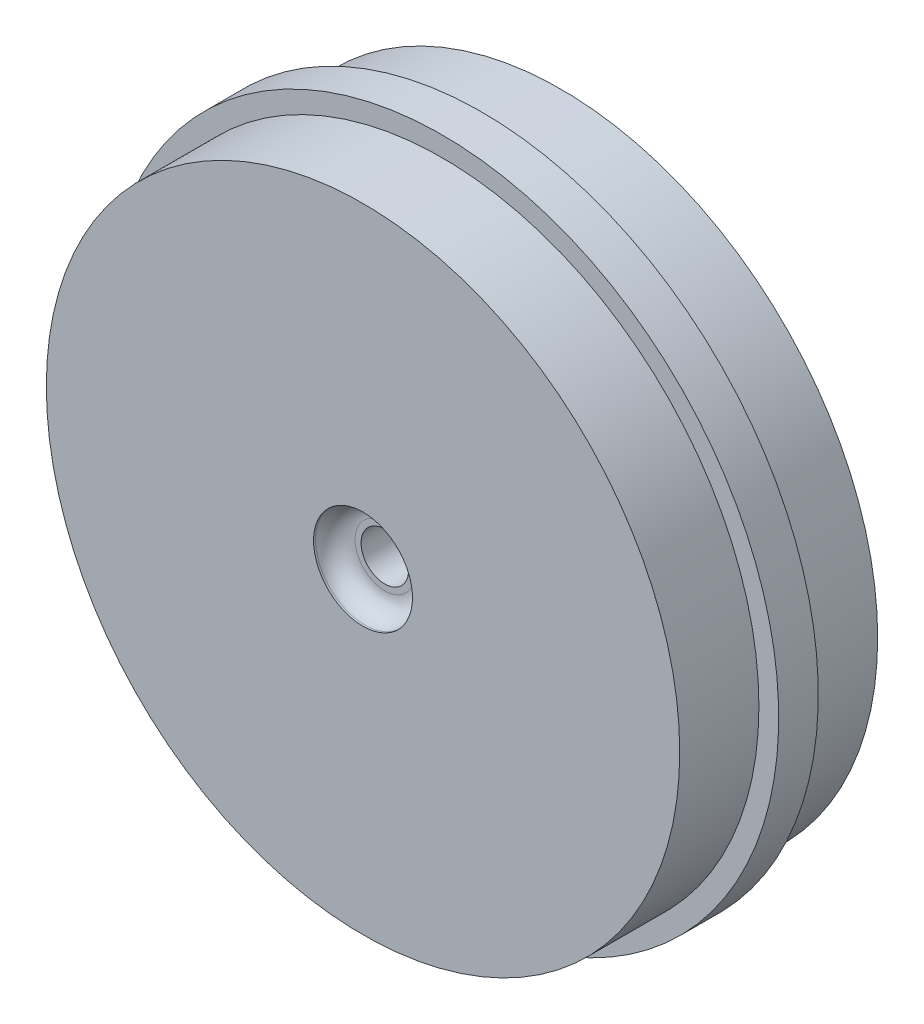
ISO-10303-21;
HEADER;
FILE_DESCRIPTION(('STEP AP214'),'2;1');
FILE_NAME('part.step','',(''),(''),'','','');
FILE_SCHEMA(('AUTOMOTIVE_DESIGN { 1 0 10303 214 1 1 1 1 }'));
ENDSEC;
DATA;
#1=APPLICATION_CONTEXT('core data for automotive mechanical design processes');
#2=APPLICATION_PROTOCOL_DEFINITION('international standard','automotive_design',2000,#1);
#3=PRODUCT_CONTEXT('',#1,'mechanical');
#4=PRODUCT('Part','Part','',(#3));
#5=PRODUCT_RELATED_PRODUCT_CATEGORY('part','',(#4));
#6=PRODUCT_DEFINITION_FORMATION('','',#4);
#7=PRODUCT_DEFINITION_CONTEXT('part definition',#1,'design');
#8=PRODUCT_DEFINITION('design','',#6,#7);
#9=PRODUCT_DEFINITION_SHAPE('','',#8);
#10=(LENGTH_UNIT() NAMED_UNIT(*) SI_UNIT(.MILLI.,.METRE.));
#11=(NAMED_UNIT(*) PLANE_ANGLE_UNIT() SI_UNIT($,.RADIAN.));
#12=(NAMED_UNIT(*) SI_UNIT($,.STERADIAN.) SOLID_ANGLE_UNIT());
#13=UNCERTAINTY_MEASURE_WITH_UNIT(LENGTH_MEASURE(1.E-05),#10,'distance_accuracy_value','');
#14=(GEOMETRIC_REPRESENTATION_CONTEXT(3) GLOBAL_UNCERTAINTY_ASSIGNED_CONTEXT((#13)) GLOBAL_UNIT_ASSIGNED_CONTEXT((#10,
#11,#12)) REPRESENTATION_CONTEXT('',''));
#15=CARTESIAN_POINT('',(0.,0.,0.));
#16=DIRECTION('',(0.,0.,1.));
#17=DIRECTION('',(1.,0.,0.));
#18=AXIS2_PLACEMENT_3D('',#15,#16,#17);
#19=CARTESIAN_POINT('',(0.,0.,20.));
#20=DIRECTION('',(0.,0.,-1.));
#21=DIRECTION('',(-1.,0.,0.));
#22=AXIS2_PLACEMENT_3D('',#19,#20,#21);
#23=CYLINDRICAL_SURFACE('',#22,16.);
#24=CARTESIAN_POINT('',(0.,0.,10.));
#25=DIRECTION('',(0.,0.,1.));
#26=DIRECTION('',(1.,0.,0.));
#27=AXIS2_PLACEMENT_3D('',#24,#25,#26);
#28=CIRCLE('',#27,16.);
#29=CARTESIAN_POINT('',(16.,0.,10.));
#30=VERTEX_POINT('',#29);
#31=EDGE_CURVE('E110',#30,#30,#28,.T.);
#32=ORIENTED_EDGE('',*,*,#31,.F.);
#33=EDGE_LOOP('',(#32));
#34=FACE_BOUND('',#33,.T.);
#35=CARTESIAN_POINT('',(0.,0.,6.));
#36=DIRECTION('',(0.,0.,-1.));
#37=DIRECTION('',(-1.,0.,0.));
#38=AXIS2_PLACEMENT_3D('',#35,#36,#37);
#39=CIRCLE('',#38,16.);
#40=CARTESIAN_POINT('',(-16.,0.,6.));
#41=VERTEX_POINT('',#40);
#42=EDGE_CURVE('E188',#41,#41,#39,.T.);
#43=ORIENTED_EDGE('',*,*,#42,.F.);
#44=EDGE_LOOP('',(#43));
#45=FACE_BOUND('',#44,.T.);
#46=ADVANCED_FACE('F37',(#34,#45),#23,.T.);
#47=CARTESIAN_POINT('',(0.,0.,0.));
#48=DIRECTION('',(0.,0.,1.));
#49=DIRECTION('',(1.,0.,0.));
#50=AXIS2_PLACEMENT_3D('',#47,#48,#49);
#51=PLANE('',#50);
#52=CARTESIAN_POINT('',(0.,0.,0.));
#53=DIRECTION('',(0.,0.,-1.));
#54=DIRECTION('',(-1.,0.,0.));
#55=AXIS2_PLACEMENT_3D('',#52,#53,#54);
#56=CIRCLE('',#55,13.5);
#57=CARTESIAN_POINT('',(-13.5,0.,0.));
#58=VERTEX_POINT('',#57);
#59=EDGE_CURVE('E119',#58,#58,#56,.T.);
#60=ORIENTED_EDGE('',*,*,#59,.F.);
#61=EDGE_LOOP('',(#60));
#62=FACE_BOUND('',#61,.T.);
#63=CARTESIAN_POINT('',(0.,0.,0.));
#64=DIRECTION('',(0.,0.,-1.));
#65=DIRECTION('',(-1.,0.,0.));
#66=AXIS2_PLACEMENT_3D('',#63,#64,#65);
#67=CIRCLE('',#66,16.);
#68=CARTESIAN_POINT('',(-16.,0.,0.));
#69=VERTEX_POINT('',#68);
#70=EDGE_CURVE('E136',#69,#69,#67,.T.);
#71=ORIENTED_EDGE('',*,*,#70,.T.);
#72=EDGE_LOOP('',(#71));
#73=FACE_BOUND('',#72,.T.);
#74=ADVANCED_FACE('F153',(#62,#73),#51,.F.);
#75=CARTESIAN_POINT('',(0.,0.,10.));
#76=DIRECTION('',(0.,0.,1.));
#77=DIRECTION('',(1.,0.,0.));
#78=AXIS2_PLACEMENT_3D('',#75,#76,#77);
#79=PLANE('',#78);
#80=ORIENTED_EDGE('',*,*,#31,.T.);
#81=EDGE_LOOP('',(#80));
#82=FACE_BOUND('',#81,.T.);
#83=CARTESIAN_POINT('',(0.,0.,10.));
#84=DIRECTION('',(0.,0.,1.));
#85=DIRECTION('',(1.,0.,0.));
#86=AXIS2_PLACEMENT_3D('',#83,#84,#85);
#87=CIRCLE('',#86,2.5);
#88=CARTESIAN_POINT('',(2.5,0.,10.));
#89=VERTEX_POINT('',#88);
#90=EDGE_CURVE('E192',#89,#89,#87,.T.);
#91=ORIENTED_EDGE('',*,*,#90,.F.);
#92=EDGE_LOOP('',(#91));
#93=FACE_BOUND('',#92,.T.);
#94=ADVANCED_FACE('F160',(#82,#93),#79,.T.);
#95=CARTESIAN_POINT('',(0.,0.,9.));
#96=DIRECTION('',(0.,0.,1.));
#97=DIRECTION('',(1.,0.,0.));
#98=AXIS2_PLACEMENT_3D('',#95,#96,#97);
#99=CYLINDRICAL_SURFACE('',#98,1.2);
#100=CARTESIAN_POINT('',(0.,0.,7.));
#101=DIRECTION('',(0.,0.,-1.));
#102=DIRECTION('',(-1.,0.,0.));
#103=AXIS2_PLACEMENT_3D('',#100,#101,#102);
#104=CIRCLE('',#103,1.2);
#105=CARTESIAN_POINT('',(-1.2,0.,7.));
#106=VERTEX_POINT('',#105);
#107=EDGE_CURVE('E116',#106,#106,#104,.F.);
#108=ORIENTED_EDGE('',*,*,#107,.F.);
#109=EDGE_LOOP('',(#108));
#110=FACE_BOUND('',#109,.T.);
#111=CARTESIAN_POINT('',(0.,0.,8.9));
#112=DIRECTION('',(0.,0.,1.));
#113=DIRECTION('',(1.,0.,0.));
#114=AXIS2_PLACEMENT_3D('',#111,#112,#113);
#115=CIRCLE('',#114,1.2);
#116=CARTESIAN_POINT('',(1.2,0.,8.9));
#117=VERTEX_POINT('',#116);
#118=EDGE_CURVE('E195',#117,#117,#115,.T.);
#119=ORIENTED_EDGE('',*,*,#118,.T.);
#120=EDGE_LOOP('',(#119));
#121=FACE_BOUND('',#120,.T.);
#122=ADVANCED_FACE('F199',(#110,#121),#99,.F.);
#123=DIRECTION('',(0.,-1.,0.));
#124=VECTOR('',#123,1.);
#125=CARTESIAN_POINT('',(1.9,1.9880895352071,0.));
#126=LINE('',#125,#124);
#127=CARTESIAN_POINT('',(1.9,1.9880895352071,0.));
#128=VERTEX_POINT('',#127);
#129=CARTESIAN_POINT('',(1.9,-1.9880895352071,0.));
#130=VERTEX_POINT('',#129);
#131=EDGE_CURVE('E87',#128,#130,#126,.T.);
#132=ORIENTED_EDGE('',*,*,#131,.F.);
#133=CARTESIAN_POINT('',(0.,0.,0.));
#134=DIRECTION('',(0.,0.,-1.));
#135=DIRECTION('',(-1.,0.,0.));
#136=AXIS2_PLACEMENT_3D('',#133,#134,#135);
#137=CIRCLE('',#136,2.75);
#138=CARTESIAN_POINT('',(-1.9,1.9880895352071,0.));
#139=VERTEX_POINT('',#138);
#140=EDGE_CURVE('E52',#139,#128,#137,.T.);
#141=ORIENTED_EDGE('',*,*,#140,.F.);
#142=DIRECTION('',(0.,1.,0.));
#143=VECTOR('',#142,1.);
#144=CARTESIAN_POINT('',(-1.9,1.9880895352071,0.));
#145=LINE('',#144,#143);
#146=CARTESIAN_POINT('',(-1.9,-1.9880895352071,0.));
#147=VERTEX_POINT('',#146);
#148=EDGE_CURVE('E104',#147,#139,#145,.T.);
#149=ORIENTED_EDGE('',*,*,#148,.F.);
#150=CARTESIAN_POINT('',(0.,0.,0.));
#151=DIRECTION('',(0.,0.,-1.));
#152=DIRECTION('',(-1.,0.,0.));
#153=AXIS2_PLACEMENT_3D('',#150,#151,#152);
#154=CIRCLE('',#153,2.75);
#155=EDGE_CURVE('E112',#130,#147,#154,.T.);
#156=ORIENTED_EDGE('',*,*,#155,.F.);
#157=EDGE_LOOP('',(#132,#141,#149,#156));
#158=FACE_BOUND('',#157,.T.);
#159=CARTESIAN_POINT('',(0.,0.,0.));
#160=DIRECTION('',(0.,0.,-1.));
#161=DIRECTION('',(-1.,0.,0.));
#162=AXIS2_PLACEMENT_3D('',#159,#160,#161);
#163=CIRCLE('',#162,4.2);
#164=CARTESIAN_POINT('',(-4.2,0.,0.));
#165=VERTEX_POINT('',#164);
#166=EDGE_CURVE('E123',#165,#165,#163,.T.);
#167=ORIENTED_EDGE('',*,*,#166,.T.);
#168=EDGE_LOOP('',(#167));
#169=FACE_BOUND('',#168,.T.);
#170=ADVANCED_FACE('F162',(#158,#169),#51,.F.);
#171=CARTESIAN_POINT('',(0.,0.,9.));
#172=DIRECTION('',(0.,0.,1.));
#173=DIRECTION('',(1.,0.,0.));
#174=AXIS2_PLACEMENT_3D('',#171,#172,#173);
#175=CYLINDRICAL_SURFACE('',#174,2.5);
#176=CARTESIAN_POINT('',(0.,0.,9.9));
#177=DIRECTION('',(0.,0.,1.));
#178=DIRECTION('',(1.,0.,0.));
#179=AXIS2_PLACEMENT_3D('',#176,#177,#178);
#180=CIRCLE('',#179,2.5);
#181=CARTESIAN_POINT('',(2.5,0.,9.9));
#182=VERTEX_POINT('',#181);
#183=EDGE_CURVE('E12',#182,#182,#180,.F.);
#184=ORIENTED_EDGE('',*,*,#183,.T.);
#185=EDGE_LOOP('',(#184));
#186=FACE_BOUND('',#185,.T.);
#187=ORIENTED_EDGE('',*,*,#90,.T.);
#188=EDGE_LOOP('',(#187));
#189=FACE_BOUND('',#188,.T.);
#190=ADVANCED_FACE('F207',(#186,#189),#175,.F.);
#191=CARTESIAN_POINT('',(0.,0.,47.1837661840736));
#192=DIRECTION('',(0.,0.,-1.));
#193=DIRECTION('',(-1.,0.,0.));
#194=AXIS2_PLACEMENT_3D('',#191,#192,#193);
#195=CYLINDRICAL_SURFACE('',#194,13.5);
#196=ORIENTED_EDGE('',*,*,#59,.T.);
#197=EDGE_LOOP('',(#196));
#198=FACE_BOUND('',#197,.T.);
#199=CARTESIAN_POINT('',(0.,0.,7.));
#200=DIRECTION('',(0.,0.,1.));
#201=DIRECTION('',(1.,0.,0.));
#202=AXIS2_PLACEMENT_3D('',#199,#200,#201);
#203=CIRCLE('',#202,13.5);
#204=CARTESIAN_POINT('',(13.5,0.,7.));
#205=VERTEX_POINT('',#204);
#206=EDGE_CURVE('E126',#205,#205,#203,.F.);
#207=ORIENTED_EDGE('',*,*,#206,.F.);
#208=EDGE_LOOP('',(#207));
#209=FACE_BOUND('',#208,.T.);
#210=ADVANCED_FACE('F215',(#198,#209),#195,.F.);
#211=CARTESIAN_POINT('',(0.,0.,47.1837661840736));
#212=DIRECTION('',(0.,0.,-1.));
#213=DIRECTION('',(-1.,0.,0.));
#214=AXIS2_PLACEMENT_3D('',#211,#212,#213);
#215=CYLINDRICAL_SURFACE('',#214,4.2);
#216=ORIENTED_EDGE('',*,*,#166,.F.);
#217=EDGE_LOOP('',(#216));
#218=FACE_BOUND('',#217,.T.);
#219=CARTESIAN_POINT('',(0.,0.,7.));
#220=DIRECTION('',(0.,0.,1.));
#221=DIRECTION('',(1.,0.,0.));
#222=AXIS2_PLACEMENT_3D('',#219,#220,#221);
#223=CIRCLE('',#222,4.2);
#224=CARTESIAN_POINT('',(4.2,0.,7.));
#225=VERTEX_POINT('',#224);
#226=EDGE_CURVE('E122',#225,#225,#223,.F.);
#227=ORIENTED_EDGE('',*,*,#226,.T.);
#228=EDGE_LOOP('',(#227));
#229=FACE_BOUND('',#228,.T.);
#230=ADVANCED_FACE('F220',(#218,#229),#215,.T.);
#231=CARTESIAN_POINT('',(0.,0.,7.));
#232=DIRECTION('',(0.,0.,1.));
#233=DIRECTION('',(1.,0.,0.));
#234=AXIS2_PLACEMENT_3D('',#231,#232,#233);
#235=PLANE('',#234);
#236=ORIENTED_EDGE('',*,*,#206,.T.);
#237=EDGE_LOOP('',(#236));
#238=FACE_BOUND('',#237,.T.);
#239=ORIENTED_EDGE('',*,*,#226,.F.);
#240=EDGE_LOOP('',(#239));
#241=FACE_BOUND('',#240,.T.);
#242=ADVANCED_FACE('F217',(#238,#241),#235,.F.);
#243=CARTESIAN_POINT('',(0.,0.,7.));
#244=DIRECTION('',(0.,0.,-1.));
#245=DIRECTION('',(-1.,0.,0.));
#246=AXIS2_PLACEMENT_3D('',#243,#244,#245);
#247=PLANE('',#246);
#248=CARTESIAN_POINT('',(0.,0.,7.));
#249=DIRECTION('',(0.,0.,-1.));
#250=DIRECTION('',(-1.,0.,0.));
#251=AXIS2_PLACEMENT_3D('',#248,#249,#250);
#252=CIRCLE('',#251,2.75);
#253=CARTESIAN_POINT('',(-1.9,1.9880895352071,7.));
#254=VERTEX_POINT('',#253);
#255=CARTESIAN_POINT('',(1.9,1.9880895352071,7.));
#256=VERTEX_POINT('',#255);
#257=EDGE_CURVE('E102',#254,#256,#252,.T.);
#258=ORIENTED_EDGE('',*,*,#257,.T.);
#259=DIRECTION('',(0.,-1.,0.));
#260=VECTOR('',#259,1.);
#261=CARTESIAN_POINT('',(1.9,1.9880895352071,7.));
#262=LINE('',#261,#260);
#263=CARTESIAN_POINT('',(1.9,-1.9880895352071,7.));
#264=VERTEX_POINT('',#263);
#265=EDGE_CURVE('E84',#256,#264,#262,.T.);
#266=ORIENTED_EDGE('',*,*,#265,.T.);
#267=CARTESIAN_POINT('',(0.,0.,7.));
#268=DIRECTION('',(0.,0.,-1.));
#269=DIRECTION('',(-1.,0.,0.));
#270=AXIS2_PLACEMENT_3D('',#267,#268,#269);
#271=CIRCLE('',#270,2.75);
#272=CARTESIAN_POINT('',(-1.9,-1.9880895352071,7.));
#273=VERTEX_POINT('',#272);
#274=EDGE_CURVE('E94',#264,#273,#271,.T.);
#275=ORIENTED_EDGE('',*,*,#274,.T.);
#276=DIRECTION('',(0.,1.,0.));
#277=VECTOR('',#276,1.);
#278=CARTESIAN_POINT('',(-1.9,1.9880895352071,7.));
#279=LINE('',#278,#277);
#280=EDGE_CURVE('E98',#273,#254,#279,.T.);
#281=ORIENTED_EDGE('',*,*,#280,.T.);
#282=EDGE_LOOP('',(#258,#266,#275,#281));
#283=FACE_BOUND('',#282,.T.);
#284=ORIENTED_EDGE('',*,*,#107,.T.);
#285=EDGE_LOOP('',(#284));
#286=FACE_BOUND('',#285,.T.);
#287=ADVANCED_FACE('F100',(#283,#286),#247,.T.);
#288=CARTESIAN_POINT('',(0.,0.,7.));
#289=DIRECTION('',(0.,0.,-1.));
#290=DIRECTION('',(-1.,0.,0.));
#291=AXIS2_PLACEMENT_3D('',#288,#289,#290);
#292=CYLINDRICAL_SURFACE('',#291,2.75);
#293=ORIENTED_EDGE('',*,*,#140,.T.);
#294=DIRECTION('',(0.,0.,-1.));
#295=VECTOR('',#294,1.);
#296=CARTESIAN_POINT('',(1.9,1.9880895352071,7.));
#297=LINE('',#296,#295);
#298=EDGE_CURVE('E75',#256,#128,#297,.T.);
#299=ORIENTED_EDGE('',*,*,#298,.F.);
#300=ORIENTED_EDGE('',*,*,#257,.F.);
#301=DIRECTION('',(0.,0.,-1.));
#302=VECTOR('',#301,1.);
#303=CARTESIAN_POINT('',(-1.9,1.9880895352071,7.));
#304=LINE('',#303,#302);
#305=EDGE_CURVE('E60',#254,#139,#304,.T.);
#306=ORIENTED_EDGE('',*,*,#305,.T.);
#307=EDGE_LOOP('',(#293,#299,#300,#306));
#308=FACE_BOUND('',#307,.T.);
#309=ADVANCED_FACE('F228',(#308),#292,.F.);
#310=CARTESIAN_POINT('',(-1.9,1.9880895352071,7.));
#311=DIRECTION('',(-1.,0.,0.));
#312=DIRECTION('',(0.,0.,1.));
#313=AXIS2_PLACEMENT_3D('',#310,#311,#312);
#314=PLANE('',#313);
#315=ORIENTED_EDGE('',*,*,#148,.T.);
#316=ORIENTED_EDGE('',*,*,#305,.F.);
#317=ORIENTED_EDGE('',*,*,#280,.F.);
#318=DIRECTION('',(0.,0.,-1.));
#319=VECTOR('',#318,1.);
#320=CARTESIAN_POINT('',(-1.9,-1.9880895352071,7.));
#321=LINE('',#320,#319);
#322=EDGE_CURVE('E91',#273,#147,#321,.T.);
#323=ORIENTED_EDGE('',*,*,#322,.T.);
#324=EDGE_LOOP('',(#315,#316,#317,#323));
#325=FACE_BOUND('',#324,.T.);
#326=ADVANCED_FACE('F230',(#325),#314,.F.);
#327=CARTESIAN_POINT('',(0.,0.,7.));
#328=DIRECTION('',(0.,0.,-1.));
#329=DIRECTION('',(-1.,0.,0.));
#330=AXIS2_PLACEMENT_3D('',#327,#328,#329);
#331=CYLINDRICAL_SURFACE('',#330,2.75);
#332=ORIENTED_EDGE('',*,*,#155,.T.);
#333=ORIENTED_EDGE('',*,*,#322,.F.);
#334=ORIENTED_EDGE('',*,*,#274,.F.);
#335=DIRECTION('',(0.,0.,-1.));
#336=VECTOR('',#335,1.);
#337=CARTESIAN_POINT('',(1.9,-1.9880895352071,7.));
#338=LINE('',#337,#336);
#339=EDGE_CURVE('E80',#264,#130,#338,.T.);
#340=ORIENTED_EDGE('',*,*,#339,.T.);
#341=EDGE_LOOP('',(#332,#333,#334,#340));
#342=FACE_BOUND('',#341,.T.);
#343=ADVANCED_FACE('F95',(#342),#331,.F.);
#344=CARTESIAN_POINT('',(1.9,1.9880895352071,7.));
#345=DIRECTION('',(1.,0.,0.));
#346=DIRECTION('',(0.,0.,-1.));
#347=AXIS2_PLACEMENT_3D('',#344,#345,#346);
#348=PLANE('',#347);
#349=ORIENTED_EDGE('',*,*,#131,.T.);
#350=ORIENTED_EDGE('',*,*,#339,.F.);
#351=ORIENTED_EDGE('',*,*,#265,.F.);
#352=ORIENTED_EDGE('',*,*,#298,.T.);
#353=EDGE_LOOP('',(#349,#350,#351,#352));
#354=FACE_BOUND('',#353,.T.);
#355=ADVANCED_FACE('F82',(#354),#348,.F.);
#356=CARTESIAN_POINT('',(0.,0.,4.));
#357=DIRECTION('',(0.,0.,-1.));
#358=DIRECTION('',(-1.,0.,0.));
#359=AXIS2_PLACEMENT_3D('',#356,#357,#358);
#360=CIRCLE('',#359,16.);
#361=CARTESIAN_POINT('',(-16.,0.,4.));
#362=VERTEX_POINT('',#361);
#363=EDGE_CURVE('E129',#362,#362,#360,.F.);
#364=ORIENTED_EDGE('',*,*,#363,.F.);
#365=EDGE_LOOP('',(#364));
#366=FACE_BOUND('',#365,.T.);
#367=ORIENTED_EDGE('',*,*,#70,.F.);
#368=EDGE_LOOP('',(#367));
#369=FACE_BOUND('',#368,.T.);
#370=ADVANCED_FACE('F156',(#366,#369),#23,.T.);
#371=CARTESIAN_POINT('',(0.,0.,6.));
#372=DIRECTION('',(0.,0.,-1.));
#373=DIRECTION('',(-1.,0.,0.));
#374=AXIS2_PLACEMENT_3D('',#371,#372,#373);
#375=CYLINDRICAL_SURFACE('',#374,17.);
#376=CARTESIAN_POINT('',(0.,0.,6.));
#377=DIRECTION('',(0.,0.,-1.));
#378=DIRECTION('',(-1.,0.,0.));
#379=AXIS2_PLACEMENT_3D('',#376,#377,#378);
#380=CIRCLE('',#379,17.);
#381=CARTESIAN_POINT('',(-17.,0.,6.));
#382=VERTEX_POINT('',#381);
#383=EDGE_CURVE('E182',#382,#382,#380,.T.);
#384=ORIENTED_EDGE('',*,*,#383,.T.);
#385=EDGE_LOOP('',(#384));
#386=FACE_BOUND('',#385,.T.);
#387=CARTESIAN_POINT('',(0.,0.,4.));
#388=DIRECTION('',(0.,0.,-1.));
#389=DIRECTION('',(-1.,0.,0.));
#390=AXIS2_PLACEMENT_3D('',#387,#388,#389);
#391=CIRCLE('',#390,17.);
#392=CARTESIAN_POINT('',(-17.,0.,4.));
#393=VERTEX_POINT('',#392);
#394=EDGE_CURVE('E184',#393,#393,#391,.T.);
#395=ORIENTED_EDGE('',*,*,#394,.F.);
#396=EDGE_LOOP('',(#395));
#397=FACE_BOUND('',#396,.T.);
#398=ADVANCED_FACE('F168',(#386,#397),#375,.T.);
#399=CARTESIAN_POINT('',(0.,0.,6.));
#400=DIRECTION('',(0.,0.,-1.));
#401=DIRECTION('',(-1.,0.,0.));
#402=AXIS2_PLACEMENT_3D('',#399,#400,#401);
#403=PLANE('',#402);
#404=ORIENTED_EDGE('',*,*,#42,.T.);
#405=EDGE_LOOP('',(#404));
#406=FACE_BOUND('',#405,.T.);
#407=ORIENTED_EDGE('',*,*,#383,.F.);
#408=EDGE_LOOP('',(#407));
#409=FACE_BOUND('',#408,.T.);
#410=ADVANCED_FACE('F174',(#406,#409),#403,.F.);
#411=CARTESIAN_POINT('',(0.,0.,4.));
#412=DIRECTION('',(0.,0.,-1.));
#413=DIRECTION('',(-1.,0.,0.));
#414=AXIS2_PLACEMENT_3D('',#411,#412,#413);
#415=PLANE('',#414);
#416=ORIENTED_EDGE('',*,*,#363,.T.);
#417=EDGE_LOOP('',(#416));
#418=FACE_BOUND('',#417,.T.);
#419=ORIENTED_EDGE('',*,*,#394,.T.);
#420=EDGE_LOOP('',(#419));
#421=FACE_BOUND('',#420,.T.);
#422=ADVANCED_FACE('F149',(#418,#421),#415,.T.);
#423=CARTESIAN_POINT('',(0.,0.,8.9));
#424=DIRECTION('',(0.,0.,1.));
#425=DIRECTION('',(1.,0.,0.));
#426=AXIS2_PLACEMENT_3D('',#423,#424,#425);
#427=PLANE('',#426);
#428=CARTESIAN_POINT('',(0.,0.,8.9));
#429=DIRECTION('',(0.,0.,1.));
#430=DIRECTION('',(1.,0.,0.));
#431=AXIS2_PLACEMENT_3D('',#428,#429,#430);
#432=CIRCLE('',#431,1.5);
#433=CARTESIAN_POINT('',(1.5,0.,8.9));
#434=VERTEX_POINT('',#433);
#435=EDGE_CURVE('E45',#434,#434,#432,.T.);
#436=ORIENTED_EDGE('',*,*,#435,.T.);
#437=EDGE_LOOP('',(#436));
#438=FACE_BOUND('',#437,.T.);
#439=ORIENTED_EDGE('',*,*,#118,.F.);
#440=EDGE_LOOP('',(#439));
#441=FACE_BOUND('',#440,.T.);
#442=ADVANCED_FACE('F141',(#438,#441),#427,.T.);
#443=CARTESIAN_POINT('',(0.,0.,9.9));
#444=DIRECTION('',(0.,0.,1.));
#445=DIRECTION('',(1.,0.,0.));
#446=AXIS2_PLACEMENT_3D('',#443,#444,#445);
#447=TOROIDAL_SURFACE('',#446,1.5,1.);
#448=ORIENTED_EDGE('',*,*,#183,.F.);
#449=EDGE_LOOP('',(#448));
#450=FACE_BOUND('',#449,.T.);
#451=ORIENTED_EDGE('',*,*,#435,.F.);
#452=EDGE_LOOP('',(#451));
#453=FACE_BOUND('',#452,.T.);
#454=ADVANCED_FACE('F39',(#450,#453),#447,.F.);
#455=CLOSED_SHELL('',(#46,#74,#94,#122,#170,#190,#210,#230,#242,#287,#309,#326,#343,#355,#370,
#398,#410,#422,#442,#454));
#456=MANIFOLD_SOLID_BREP('B2',#455);
#457=ADVANCED_BREP_SHAPE_REPRESENTATION('',(#18,#456),#14);
#458=SHAPE_DEFINITION_REPRESENTATION(#9,#457);
ENDSEC;
END-ISO-10303-21;
